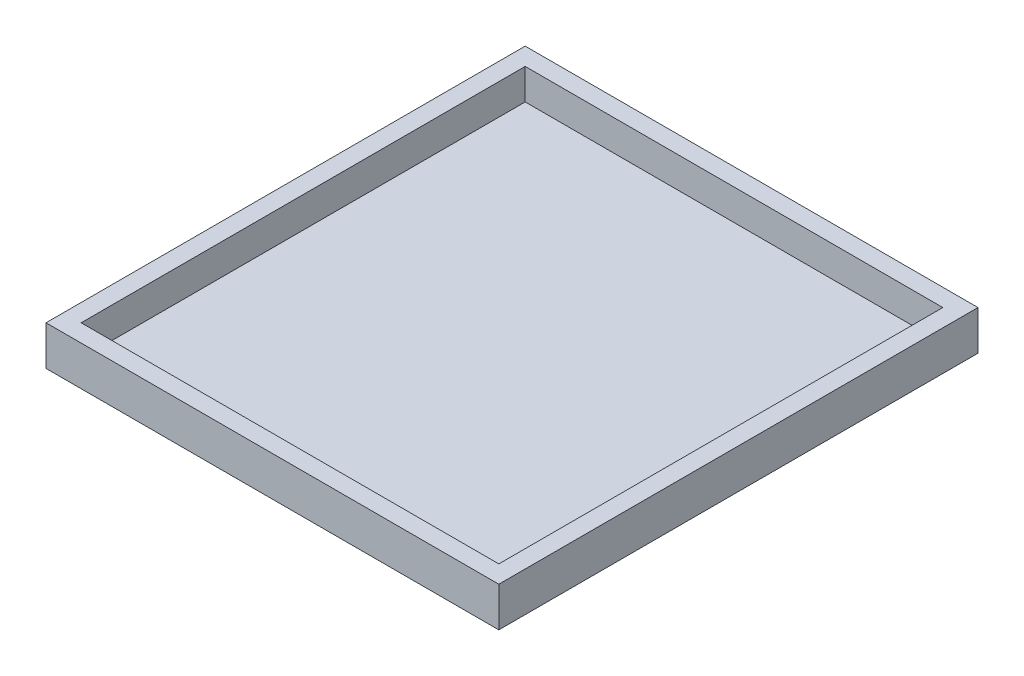
ISO-10303-21;
HEADER;
FILE_DESCRIPTION(('STEP AP214'),'2;1');
FILE_NAME('part.step','',(''),(''),'','','');
FILE_SCHEMA(('AUTOMOTIVE_DESIGN { 1 0 10303 214 1 1 1 1 }'));
ENDSEC;
DATA;
#1=APPLICATION_CONTEXT('core data for automotive mechanical design processes');
#2=APPLICATION_PROTOCOL_DEFINITION('international standard','automotive_design',2000,#1);
#3=PRODUCT_CONTEXT('',#1,'mechanical');
#4=PRODUCT('Part','Part','',(#3));
#5=PRODUCT_RELATED_PRODUCT_CATEGORY('part','',(#4));
#6=PRODUCT_DEFINITION_FORMATION('','',#4);
#7=PRODUCT_DEFINITION_CONTEXT('part definition',#1,'design');
#8=PRODUCT_DEFINITION('design','',#6,#7);
#9=PRODUCT_DEFINITION_SHAPE('','',#8);
#10=(LENGTH_UNIT() NAMED_UNIT(*) SI_UNIT(.MILLI.,.METRE.));
#11=(NAMED_UNIT(*) PLANE_ANGLE_UNIT() SI_UNIT($,.RADIAN.));
#12=(NAMED_UNIT(*) SI_UNIT($,.STERADIAN.) SOLID_ANGLE_UNIT());
#13=UNCERTAINTY_MEASURE_WITH_UNIT(LENGTH_MEASURE(1.E-05),#10,'distance_accuracy_value','');
#14=(GEOMETRIC_REPRESENTATION_CONTEXT(3) GLOBAL_UNCERTAINTY_ASSIGNED_CONTEXT((#13)) GLOBAL_UNIT_ASSIGNED_CONTEXT((#10,
#11,#12)) REPRESENTATION_CONTEXT('',''));
#15=CARTESIAN_POINT('',(0.,0.,0.));
#16=DIRECTION('',(0.,0.,1.));
#17=DIRECTION('',(1.,0.,0.));
#18=AXIS2_PLACEMENT_3D('',#15,#16,#17);
#19=CARTESIAN_POINT('',(-51.5,9.,-39.7063321139347));
#20=DIRECTION('',(1.,0.,0.));
#21=DIRECTION('',(0.,0.,-1.));
#22=AXIS2_PLACEMENT_3D('',#19,#20,#21);
#23=PLANE('',#22);
#24=DIRECTION('',(0.,-1.,0.));
#25=VECTOR('',#24,1.);
#26=CARTESIAN_POINT('',(-51.5,9.,-39.7063321139347));
#27=LINE('',#26,#25);
#28=CARTESIAN_POINT('',(-51.5,9.,-39.7063321139347));
#29=VERTEX_POINT('',#28);
#30=CARTESIAN_POINT('',(-51.5,0.,-39.7063321139347));
#31=VERTEX_POINT('',#30);
#32=EDGE_CURVE('E157',#29,#31,#27,.T.);
#33=ORIENTED_EDGE('',*,*,#32,.T.);
#34=DIRECTION('',(0.,0.,-1.));
#35=VECTOR('',#34,1.);
#36=CARTESIAN_POINT('',(-51.5,0.,-39.7063321139347));
#37=LINE('',#36,#35);
#38=CARTESIAN_POINT('',(-51.5,0.,69.2936678860653));
#39=VERTEX_POINT('',#38);
#40=EDGE_CURVE('E120',#39,#31,#37,.T.);
#41=ORIENTED_EDGE('',*,*,#40,.F.);
#42=DIRECTION('',(0.,-1.,0.));
#43=VECTOR('',#42,1.);
#44=CARTESIAN_POINT('',(-51.5,9.,69.2936678860653));
#45=LINE('',#44,#43);
#46=CARTESIAN_POINT('',(-51.5,9.,69.2936678860653));
#47=VERTEX_POINT('',#46);
#48=EDGE_CURVE('E116',#47,#39,#45,.T.);
#49=ORIENTED_EDGE('',*,*,#48,.F.);
#50=DIRECTION('',(0.,0.,1.));
#51=VECTOR('',#50,1.);
#52=CARTESIAN_POINT('',(-51.5,9.,-39.7063321139347));
#53=LINE('',#52,#51);
#54=EDGE_CURVE('E154',#29,#47,#53,.T.);
#55=ORIENTED_EDGE('',*,*,#54,.F.);
#56=EDGE_LOOP('',(#33,#41,#49,#55));
#57=FACE_BOUND('',#56,.T.);
#58=ADVANCED_FACE('F33',(#57),#23,.F.);
#59=CARTESIAN_POINT('',(51.5,9.,-39.7063321139347));
#60=DIRECTION('',(0.,0.,1.));
#61=DIRECTION('',(1.,0.,0.));
#62=AXIS2_PLACEMENT_3D('',#59,#60,#61);
#63=PLANE('',#62);
#64=DIRECTION('',(0.,-1.,0.));
#65=VECTOR('',#64,1.);
#66=CARTESIAN_POINT('',(51.5,9.,-39.7063321139347));
#67=LINE('',#66,#65);
#68=CARTESIAN_POINT('',(51.5,9.,-39.7063321139347));
#69=VERTEX_POINT('',#68);
#70=CARTESIAN_POINT('',(51.5,0.,-39.7063321139347));
#71=VERTEX_POINT('',#70);
#72=EDGE_CURVE('E111',#69,#71,#67,.T.);
#73=ORIENTED_EDGE('',*,*,#72,.T.);
#74=DIRECTION('',(1.,0.,0.));
#75=VECTOR('',#74,1.);
#76=CARTESIAN_POINT('',(51.5,0.,-39.7063321139347));
#77=LINE('',#76,#75);
#78=EDGE_CURVE('E125',#31,#71,#77,.T.);
#79=ORIENTED_EDGE('',*,*,#78,.F.);
#80=ORIENTED_EDGE('',*,*,#32,.F.);
#81=DIRECTION('',(-1.,0.,0.));
#82=VECTOR('',#81,1.);
#83=CARTESIAN_POINT('',(51.5,9.,-39.7063321139347));
#84=LINE('',#83,#82);
#85=EDGE_CURVE('E152',#69,#29,#84,.T.);
#86=ORIENTED_EDGE('',*,*,#85,.F.);
#87=EDGE_LOOP('',(#73,#79,#80,#86));
#88=FACE_BOUND('',#87,.T.);
#89=ADVANCED_FACE('F187',(#88),#63,.F.);
#90=CARTESIAN_POINT('',(51.5,9.,69.2936678860653));
#91=DIRECTION('',(-1.,0.,0.));
#92=DIRECTION('',(0.,0.,1.));
#93=AXIS2_PLACEMENT_3D('',#90,#91,#92);
#94=PLANE('',#93);
#95=DIRECTION('',(0.,-1.,0.));
#96=VECTOR('',#95,1.);
#97=CARTESIAN_POINT('',(51.5,9.,69.2936678860653));
#98=LINE('',#97,#96);
#99=CARTESIAN_POINT('',(51.5,9.,69.2936678860653));
#100=VERTEX_POINT('',#99);
#101=CARTESIAN_POINT('',(51.5,0.,69.2936678860653));
#102=VERTEX_POINT('',#101);
#103=EDGE_CURVE('E100',#100,#102,#98,.T.);
#104=ORIENTED_EDGE('',*,*,#103,.T.);
#105=DIRECTION('',(0.,0.,1.));
#106=VECTOR('',#105,1.);
#107=CARTESIAN_POINT('',(51.5,0.,-39.7063321139347));
#108=LINE('',#107,#106);
#109=EDGE_CURVE('E105',#71,#102,#108,.T.);
#110=ORIENTED_EDGE('',*,*,#109,.F.);
#111=ORIENTED_EDGE('',*,*,#72,.F.);
#112=DIRECTION('',(0.,0.,-1.));
#113=VECTOR('',#112,1.);
#114=CARTESIAN_POINT('',(51.5,9.,69.2936678860653));
#115=LINE('',#114,#113);
#116=EDGE_CURVE('E106',#100,#69,#115,.T.);
#117=ORIENTED_EDGE('',*,*,#116,.F.);
#118=EDGE_LOOP('',(#104,#110,#111,#117));
#119=FACE_BOUND('',#118,.T.);
#120=ADVANCED_FACE('F102',(#119),#94,.F.);
#121=CARTESIAN_POINT('',(-51.5,9.,69.2936678860653));
#122=DIRECTION('',(0.,0.,-1.));
#123=DIRECTION('',(-1.,0.,0.));
#124=AXIS2_PLACEMENT_3D('',#121,#122,#123);
#125=PLANE('',#124);
#126=ORIENTED_EDGE('',*,*,#48,.T.);
#127=DIRECTION('',(-1.,0.,0.));
#128=VECTOR('',#127,1.);
#129=CARTESIAN_POINT('',(51.5,0.,69.2936678860653));
#130=LINE('',#129,#128);
#131=EDGE_CURVE('E114',#102,#39,#130,.T.);
#132=ORIENTED_EDGE('',*,*,#131,.F.);
#133=ORIENTED_EDGE('',*,*,#103,.F.);
#134=DIRECTION('',(1.,0.,0.));
#135=VECTOR('',#134,1.);
#136=CARTESIAN_POINT('',(-51.5,9.,69.2936678860653));
#137=LINE('',#136,#135);
#138=EDGE_CURVE('E143',#47,#100,#137,.T.);
#139=ORIENTED_EDGE('',*,*,#138,.F.);
#140=EDGE_LOOP('',(#126,#132,#133,#139));
#141=FACE_BOUND('',#140,.T.);
#142=ADVANCED_FACE('F35',(#141),#125,.F.);
#143=CARTESIAN_POINT('',(0.,9.,0.));
#144=DIRECTION('',(0.,1.,0.));
#145=DIRECTION('',(0.,0.,1.));
#146=AXIS2_PLACEMENT_3D('',#143,#144,#145);
#147=PLANE('',#146);
#148=ORIENTED_EDGE('',*,*,#138,.T.);
#149=ORIENTED_EDGE('',*,*,#116,.T.);
#150=ORIENTED_EDGE('',*,*,#85,.T.);
#151=ORIENTED_EDGE('',*,*,#54,.T.);
#152=EDGE_LOOP('',(#148,#149,#150,#151));
#153=FACE_BOUND('',#152,.T.);
#154=DIRECTION('',(1.,0.,0.));
#155=VECTOR('',#154,1.);
#156=CARTESIAN_POINT('',(0.,9.,-35.7063321139347));
#157=LINE('',#156,#155);
#158=CARTESIAN_POINT('',(-47.5,9.,-35.7063321139347));
#159=VERTEX_POINT('',#158);
#160=CARTESIAN_POINT('',(47.5,9.,-35.7063321139347));
#161=VERTEX_POINT('',#160);
#162=EDGE_CURVE('E133',#159,#161,#157,.T.);
#163=ORIENTED_EDGE('',*,*,#162,.T.);
#164=DIRECTION('',(0.,0.,1.));
#165=VECTOR('',#164,1.);
#166=CARTESIAN_POINT('',(47.5,9.,0.));
#167=LINE('',#166,#165);
#168=CARTESIAN_POINT('',(47.5,9.,65.2936678860653));
#169=VERTEX_POINT('',#168);
#170=EDGE_CURVE('E130',#161,#169,#167,.T.);
#171=ORIENTED_EDGE('',*,*,#170,.T.);
#172=DIRECTION('',(1.,0.,0.));
#173=VECTOR('',#172,1.);
#174=CARTESIAN_POINT('',(0.,9.,65.2936678860653));
#175=LINE('',#174,#173);
#176=CARTESIAN_POINT('',(-47.5,9.,65.2936678860653));
#177=VERTEX_POINT('',#176);
#178=EDGE_CURVE('E139',#177,#169,#175,.T.);
#179=ORIENTED_EDGE('',*,*,#178,.F.);
#180=DIRECTION('',(0.,0.,1.));
#181=VECTOR('',#180,1.);
#182=CARTESIAN_POINT('',(-47.5,9.,0.));
#183=LINE('',#182,#181);
#184=EDGE_CURVE('E136',#159,#177,#183,.T.);
#185=ORIENTED_EDGE('',*,*,#184,.F.);
#186=EDGE_LOOP('',(#163,#171,#179,#185));
#187=FACE_BOUND('',#186,.T.);
#188=ADVANCED_FACE('F170',(#153,#187),#147,.T.);
#189=CARTESIAN_POINT('',(0.,2.,-35.7063321139347));
#190=DIRECTION('',(0.,0.,1.));
#191=DIRECTION('',(1.,0.,0.));
#192=AXIS2_PLACEMENT_3D('',#189,#190,#191);
#193=PLANE('',#192);
#194=ORIENTED_EDGE('',*,*,#162,.F.);
#195=DIRECTION('',(0.,1.,0.));
#196=VECTOR('',#195,1.);
#197=CARTESIAN_POINT('',(-47.5,2.,-35.7063321139347));
#198=LINE('',#197,#196);
#199=CARTESIAN_POINT('',(-47.5,2.,-35.7063321139347));
#200=VERTEX_POINT('',#199);
#201=EDGE_CURVE('E146',#200,#159,#198,.T.);
#202=ORIENTED_EDGE('',*,*,#201,.F.);
#203=DIRECTION('',(-1.,0.,0.));
#204=VECTOR('',#203,1.);
#205=CARTESIAN_POINT('',(-47.5,2.,-35.7063321139347));
#206=LINE('',#205,#204);
#207=CARTESIAN_POINT('',(47.5,2.,-35.7063321139347));
#208=VERTEX_POINT('',#207);
#209=EDGE_CURVE('E110',#208,#200,#206,.T.);
#210=ORIENTED_EDGE('',*,*,#209,.F.);
#211=DIRECTION('',(0.,1.,0.));
#212=VECTOR('',#211,1.);
#213=CARTESIAN_POINT('',(47.5,2.,-35.7063321139347));
#214=LINE('',#213,#212);
#215=EDGE_CURVE('E141',#208,#161,#214,.T.);
#216=ORIENTED_EDGE('',*,*,#215,.T.);
#217=EDGE_LOOP('',(#194,#202,#210,#216));
#218=FACE_BOUND('',#217,.T.);
#219=ADVANCED_FACE('F175',(#218),#193,.T.);
#220=CARTESIAN_POINT('',(-47.5,2.,0.));
#221=DIRECTION('',(-1.,0.,0.));
#222=DIRECTION('',(0.,0.,1.));
#223=AXIS2_PLACEMENT_3D('',#220,#221,#222);
#224=PLANE('',#223);
#225=ORIENTED_EDGE('',*,*,#184,.T.);
#226=DIRECTION('',(0.,1.,0.));
#227=VECTOR('',#226,1.);
#228=CARTESIAN_POINT('',(-47.5,2.,65.2936678860653));
#229=LINE('',#228,#227);
#230=CARTESIAN_POINT('',(-47.5,2.,65.2936678860653));
#231=VERTEX_POINT('',#230);
#232=EDGE_CURVE('E144',#231,#177,#229,.T.);
#233=ORIENTED_EDGE('',*,*,#232,.F.);
#234=DIRECTION('',(0.,0.,1.));
#235=VECTOR('',#234,1.);
#236=CARTESIAN_POINT('',(-47.5,2.,-35.7063321139347));
#237=LINE('',#236,#235);
#238=EDGE_CURVE('E57',#200,#231,#237,.T.);
#239=ORIENTED_EDGE('',*,*,#238,.F.);
#240=ORIENTED_EDGE('',*,*,#201,.T.);
#241=EDGE_LOOP('',(#225,#233,#239,#240));
#242=FACE_BOUND('',#241,.T.);
#243=ADVANCED_FACE('F165',(#242),#224,.F.);
#244=CARTESIAN_POINT('',(0.,2.,65.2936678860653));
#245=DIRECTION('',(0.,0.,1.));
#246=DIRECTION('',(1.,0.,0.));
#247=AXIS2_PLACEMENT_3D('',#244,#245,#246);
#248=PLANE('',#247);
#249=ORIENTED_EDGE('',*,*,#178,.T.);
#250=DIRECTION('',(0.,1.,0.));
#251=VECTOR('',#250,1.);
#252=CARTESIAN_POINT('',(47.5,2.,65.2936678860653));
#253=LINE('',#252,#251);
#254=CARTESIAN_POINT('',(47.5,2.,65.2936678860653));
#255=VERTEX_POINT('',#254);
#256=EDGE_CURVE('E49',#255,#169,#253,.T.);
#257=ORIENTED_EDGE('',*,*,#256,.F.);
#258=DIRECTION('',(1.,0.,0.));
#259=VECTOR('',#258,1.);
#260=CARTESIAN_POINT('',(-47.5,2.,65.2936678860653));
#261=LINE('',#260,#259);
#262=EDGE_CURVE('E37',#231,#255,#261,.T.);
#263=ORIENTED_EDGE('',*,*,#262,.F.);
#264=ORIENTED_EDGE('',*,*,#232,.T.);
#265=EDGE_LOOP('',(#249,#257,#263,#264));
#266=FACE_BOUND('',#265,.T.);
#267=ADVANCED_FACE('F164',(#266),#248,.F.);
#268=CARTESIAN_POINT('',(47.5,2.,0.));
#269=DIRECTION('',(-1.,0.,0.));
#270=DIRECTION('',(0.,0.,1.));
#271=AXIS2_PLACEMENT_3D('',#268,#269,#270);
#272=PLANE('',#271);
#273=ORIENTED_EDGE('',*,*,#170,.F.);
#274=ORIENTED_EDGE('',*,*,#215,.F.);
#275=DIRECTION('',(0.,0.,-1.));
#276=VECTOR('',#275,1.);
#277=CARTESIAN_POINT('',(47.5,2.,-35.7063321139347));
#278=LINE('',#277,#276);
#279=EDGE_CURVE('E11',#255,#208,#278,.T.);
#280=ORIENTED_EDGE('',*,*,#279,.F.);
#281=ORIENTED_EDGE('',*,*,#256,.T.);
#282=EDGE_LOOP('',(#273,#274,#280,#281));
#283=FACE_BOUND('',#282,.T.);
#284=ADVANCED_FACE('F173',(#283),#272,.T.);
#285=CARTESIAN_POINT('',(0.,2.,0.));
#286=DIRECTION('',(0.,-1.,0.));
#287=DIRECTION('',(0.,0.,-1.));
#288=AXIS2_PLACEMENT_3D('',#285,#286,#287);
#289=PLANE('',#288);
#290=ORIENTED_EDGE('',*,*,#238,.T.);
#291=ORIENTED_EDGE('',*,*,#262,.T.);
#292=ORIENTED_EDGE('',*,*,#279,.T.);
#293=ORIENTED_EDGE('',*,*,#209,.T.);
#294=EDGE_LOOP('',(#290,#291,#292,#293));
#295=FACE_BOUND('',#294,.T.);
#296=ADVANCED_FACE('F163',(#295),#289,.F.);
#297=CARTESIAN_POINT('',(0.,0.,0.));
#298=DIRECTION('',(0.,-1.,0.));
#299=DIRECTION('',(0.,0.,-1.));
#300=AXIS2_PLACEMENT_3D('',#297,#298,#299);
#301=PLANE('',#300);
#302=ORIENTED_EDGE('',*,*,#109,.T.);
#303=ORIENTED_EDGE('',*,*,#131,.T.);
#304=ORIENTED_EDGE('',*,*,#40,.T.);
#305=ORIENTED_EDGE('',*,*,#78,.T.);
#306=EDGE_LOOP('',(#302,#303,#304,#305));
#307=FACE_BOUND('',#306,.T.);
#308=ADVANCED_FACE('F123',(#307),#301,.T.);
#309=CLOSED_SHELL('',(#58,#89,#120,#142,#188,#219,#243,#267,#284,#296,#308));
#310=MANIFOLD_SOLID_BREP('B2',#309);
#311=ADVANCED_BREP_SHAPE_REPRESENTATION('',(#18,#310),#14);
#312=SHAPE_DEFINITION_REPRESENTATION(#9,#311);
ENDSEC;
END-ISO-10303-21;
